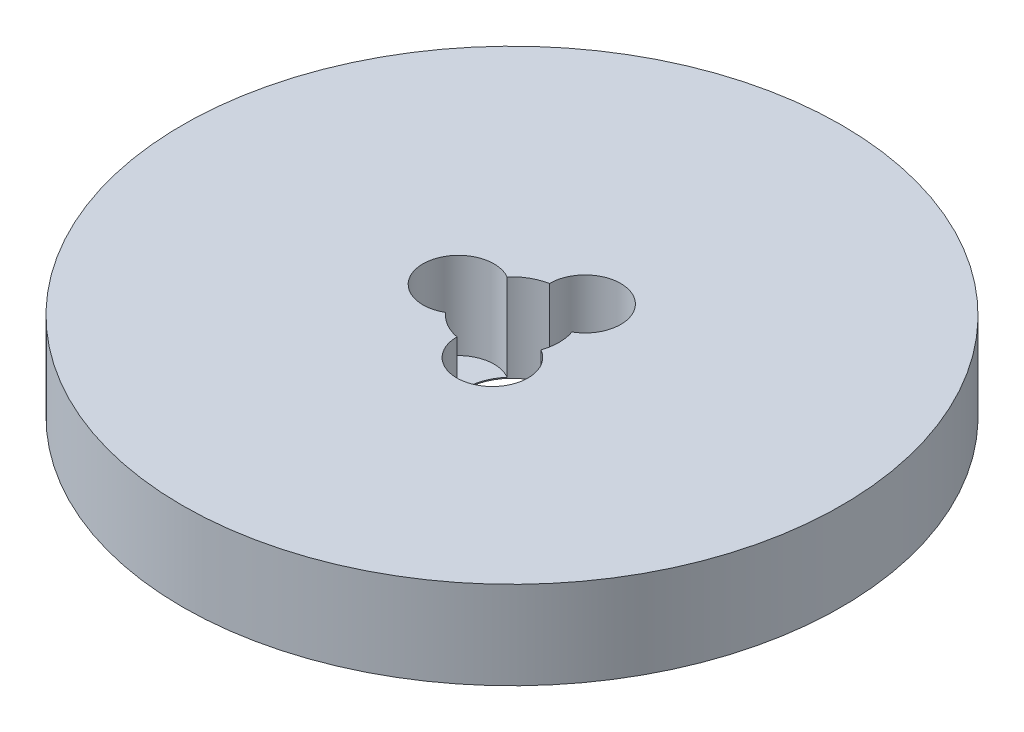
ISO-10303-21;
HEADER;
FILE_DESCRIPTION(('STEP AP214'),'2;1');
FILE_NAME('part.step','',(''),(''),'','','');
FILE_SCHEMA(('AUTOMOTIVE_DESIGN { 1 0 10303 214 1 1 1 1 }'));
ENDSEC;
DATA;
#1=APPLICATION_CONTEXT('core data for automotive mechanical design processes');
#2=APPLICATION_PROTOCOL_DEFINITION('international standard','automotive_design',2000,#1);
#3=PRODUCT_CONTEXT('',#1,'mechanical');
#4=PRODUCT('Part','Part','',(#3));
#5=PRODUCT_RELATED_PRODUCT_CATEGORY('part','',(#4));
#6=PRODUCT_DEFINITION_FORMATION('','',#4);
#7=PRODUCT_DEFINITION_CONTEXT('part definition',#1,'design');
#8=PRODUCT_DEFINITION('design','',#6,#7);
#9=PRODUCT_DEFINITION_SHAPE('','',#8);
#10=(LENGTH_UNIT() NAMED_UNIT(*) SI_UNIT(.MILLI.,.METRE.));
#11=(NAMED_UNIT(*) PLANE_ANGLE_UNIT() SI_UNIT($,.RADIAN.));
#12=(NAMED_UNIT(*) SI_UNIT($,.STERADIAN.) SOLID_ANGLE_UNIT());
#13=UNCERTAINTY_MEASURE_WITH_UNIT(LENGTH_MEASURE(1.E-05),#10,'distance_accuracy_value','');
#14=(GEOMETRIC_REPRESENTATION_CONTEXT(3) GLOBAL_UNCERTAINTY_ASSIGNED_CONTEXT((#13)) GLOBAL_UNIT_ASSIGNED_CONTEXT((#10,
#11,#12)) REPRESENTATION_CONTEXT('',''));
#15=CARTESIAN_POINT('',(0.,0.,0.));
#16=DIRECTION('',(0.,0.,1.));
#17=DIRECTION('',(1.,0.,0.));
#18=AXIS2_PLACEMENT_3D('',#15,#16,#17);
#19=CARTESIAN_POINT('',(0.,14.,0.));
#20=DIRECTION('',(0.,-1.,0.));
#21=DIRECTION('',(0.,0.,-1.));
#22=AXIS2_PLACEMENT_3D('',#19,#20,#21);
#23=CYLINDRICAL_SURFACE('',#22,52.5);
#24=CARTESIAN_POINT('',(0.,14.,0.));
#25=DIRECTION('',(0.,1.,0.));
#26=DIRECTION('',(0.,0.,1.));
#27=AXIS2_PLACEMENT_3D('',#24,#25,#26);
#28=CIRCLE('',#27,52.5);
#29=CARTESIAN_POINT('',(0.,14.,52.5));
#30=VERTEX_POINT('',#29);
#31=EDGE_CURVE('E126',#30,#30,#28,.T.);
#32=ORIENTED_EDGE('',*,*,#31,.F.);
#33=EDGE_LOOP('',(#32));
#34=FACE_BOUND('',#33,.T.);
#35=CARTESIAN_POINT('',(0.,0.,0.));
#36=DIRECTION('',(0.,1.,0.));
#37=DIRECTION('',(0.,0.,1.));
#38=AXIS2_PLACEMENT_3D('',#35,#36,#37);
#39=CIRCLE('',#38,52.5);
#40=CARTESIAN_POINT('',(0.,0.,52.5));
#41=VERTEX_POINT('',#40);
#42=EDGE_CURVE('E124',#41,#41,#39,.T.);
#43=ORIENTED_EDGE('',*,*,#42,.T.);
#44=EDGE_LOOP('',(#43));
#45=FACE_BOUND('',#44,.T.);
#46=ADVANCED_FACE('F39',(#34,#45),#23,.T.);
#47=CARTESIAN_POINT('',(0.,14.,0.));
#48=DIRECTION('',(0.,1.,0.));
#49=DIRECTION('',(0.,0.,1.));
#50=AXIS2_PLACEMENT_3D('',#47,#48,#49);
#51=PLANE('',#50);
#52=CARTESIAN_POINT('',(4.26421099276062,14.,7.38583009365503));
#53=DIRECTION('',(0.,1.,0.));
#54=DIRECTION('',(0.866025403784436,0.,-0.500000000000004));
#55=AXIS2_PLACEMENT_3D('',#52,#53,#54);
#56=CIRCLE('',#55,5.66837636374903);
#57=CARTESIAN_POINT('',(-1.40413536972342,14.,7.36738785890167));
#58=VERTEX_POINT('',#57);
#59=CARTESIAN_POINT('',(7.08241273020362,14.,2.46767702891803));
#60=VERTEX_POINT('',#59);
#61=EDGE_CURVE('E147',#58,#60,#56,.T.);
#62=ORIENTED_EDGE('',*,*,#61,.F.);
#63=CARTESIAN_POINT('',(0.,14.,0.));
#64=DIRECTION('',(0.,1.,0.));
#65=DIRECTION('',(0.,0.,1.));
#66=AXIS2_PLACEMENT_3D('',#63,#64,#65);
#67=CIRCLE('',#66,7.5);
#68=CARTESIAN_POINT('',(-5.67827736048015,14.,4.8997108299836));
#69=VERTEX_POINT('',#68);
#70=EDGE_CURVE('E118',#69,#58,#67,.T.);
#71=ORIENTED_EDGE('',*,*,#70,.F.);
#72=CARTESIAN_POINT('',(-8.52842198552116,14.,0.));
#73=DIRECTION('',(0.,1.,0.));
#74=DIRECTION('',(0.,0.,1.));
#75=AXIS2_PLACEMENT_3D('',#72,#73,#74);
#76=CIRCLE('',#75,5.66837636374903);
#77=CARTESIAN_POINT('',(-5.67827736048015,14.,-4.8997108299836));
#78=VERTEX_POINT('',#77);
#79=EDGE_CURVE('E113',#78,#69,#76,.T.);
#80=ORIENTED_EDGE('',*,*,#79,.F.);
#81=CARTESIAN_POINT('',(-1.40413536972352,14.,-7.36738785890165));
#82=VERTEX_POINT('',#81);
#83=EDGE_CURVE('E106',#82,#78,#67,.T.);
#84=ORIENTED_EDGE('',*,*,#83,.F.);
#85=CARTESIAN_POINT('',(4.26421099276051,14.,-7.38583009365509));
#86=DIRECTION('',(0.,1.,0.));
#87=DIRECTION('',(-0.866025403784443,0.,-0.499999999999992));
#88=AXIS2_PLACEMENT_3D('',#85,#86,#87);
#89=CIRCLE('',#88,5.66837636374903);
#90=CARTESIAN_POINT('',(7.08241273020358,14.,-2.46767702891813));
#91=VERTEX_POINT('',#90);
#92=EDGE_CURVE('E90',#91,#82,#89,.T.);
#93=ORIENTED_EDGE('',*,*,#92,.F.);
#94=EDGE_CURVE('E116',#60,#91,#67,.T.);
#95=ORIENTED_EDGE('',*,*,#94,.F.);
#96=EDGE_LOOP('',(#62,#71,#80,#84,#93,#95));
#97=FACE_BOUND('',#96,.T.);
#98=ORIENTED_EDGE('',*,*,#31,.T.);
#99=EDGE_LOOP('',(#98));
#100=FACE_BOUND('',#99,.T.);
#101=ADVANCED_FACE('F115',(#97,#100),#51,.T.);
#102=CARTESIAN_POINT('',(0.,0.,0.));
#103=DIRECTION('',(0.,1.,0.));
#104=DIRECTION('',(0.,0.,1.));
#105=AXIS2_PLACEMENT_3D('',#102,#103,#104);
#106=PLANE('',#105);
#107=CARTESIAN_POINT('',(0.,0.,0.));
#108=DIRECTION('',(0.,1.,0.));
#109=DIRECTION('',(0.,0.,1.));
#110=AXIS2_PLACEMENT_3D('',#107,#108,#109);
#111=CIRCLE('',#110,7.5);
#112=CARTESIAN_POINT('',(0.,0.,7.5));
#113=VERTEX_POINT('',#112);
#114=EDGE_CURVE('E120',#113,#113,#111,.T.);
#115=ORIENTED_EDGE('',*,*,#114,.T.);
#116=EDGE_LOOP('',(#115));
#117=FACE_BOUND('',#116,.T.);
#118=ORIENTED_EDGE('',*,*,#42,.F.);
#119=EDGE_LOOP('',(#118));
#120=FACE_BOUND('',#119,.T.);
#121=ADVANCED_FACE('F164',(#117,#120),#106,.F.);
#122=CARTESIAN_POINT('',(0.,14.,0.));
#123=DIRECTION('',(0.,-1.,0.));
#124=DIRECTION('',(0.,0.,-1.));
#125=AXIS2_PLACEMENT_3D('',#122,#123,#124);
#126=CYLINDRICAL_SURFACE('',#125,7.5);
#127=DIRECTION('',(0.,1.,0.));
#128=VECTOR('',#127,1.);
#129=CARTESIAN_POINT('',(-1.40413536972342,7.08116823526094,7.36738785890167));
#130=LINE('',#129,#128);
#131=CARTESIAN_POINT('',(-1.40413536972342,0.162336470521872,7.36738785890167));
#132=VERTEX_POINT('',#131);
#133=EDGE_CURVE('E11',#132,#58,#130,.T.);
#134=ORIENTED_EDGE('',*,*,#133,.F.);
#135=CARTESIAN_POINT('',(0.,0.162336470521872,0.));
#136=DIRECTION('',(0.,1.,0.));
#137=DIRECTION('',(0.,0.,1.));
#138=AXIS2_PLACEMENT_3D('',#135,#136,#137);
#139=CIRCLE('',#138,7.5);
#140=CARTESIAN_POINT('',(7.08241273020362,0.162336470521872,2.46767702891803));
#141=VERTEX_POINT('',#140);
#142=EDGE_CURVE('E144',#132,#141,#139,.T.);
#143=ORIENTED_EDGE('',*,*,#142,.T.);
#144=DIRECTION('',(0.,1.,0.));
#145=VECTOR('',#144,1.);
#146=CARTESIAN_POINT('',(7.08241273020362,7.08116823526094,2.46767702891803));
#147=LINE('',#146,#145);
#148=EDGE_CURVE('E46',#60,#141,#147,.F.);
#149=ORIENTED_EDGE('',*,*,#148,.F.);
#150=ORIENTED_EDGE('',*,*,#94,.T.);
#151=DIRECTION('',(0.,1.,0.));
#152=VECTOR('',#151,1.);
#153=CARTESIAN_POINT('',(7.08241273020358,7.08116823526094,-2.46767702891813));
#154=LINE('',#153,#152);
#155=CARTESIAN_POINT('',(7.08241273020358,0.162336470521872,-2.46767702891813));
#156=VERTEX_POINT('',#155);
#157=EDGE_CURVE('E92',#156,#91,#154,.T.);
#158=ORIENTED_EDGE('',*,*,#157,.F.);
#159=CARTESIAN_POINT('',(0.,0.162336470521872,0.));
#160=DIRECTION('',(0.,1.,0.));
#161=DIRECTION('',(0.,0.,1.));
#162=AXIS2_PLACEMENT_3D('',#159,#160,#161);
#163=CIRCLE('',#162,7.5);
#164=CARTESIAN_POINT('',(-1.40413536972352,0.162336470521872,-7.36738785890165));
#165=VERTEX_POINT('',#164);
#166=EDGE_CURVE('E107',#156,#165,#163,.T.);
#167=ORIENTED_EDGE('',*,*,#166,.T.);
#168=DIRECTION('',(0.,1.,0.));
#169=VECTOR('',#168,1.);
#170=CARTESIAN_POINT('',(-1.40413536972352,7.08116823526094,-7.36738785890165));
#171=LINE('',#170,#169);
#172=EDGE_CURVE('E95',#82,#165,#171,.F.);
#173=ORIENTED_EDGE('',*,*,#172,.F.);
#174=ORIENTED_EDGE('',*,*,#83,.T.);
#175=DIRECTION('',(0.,1.,0.));
#176=VECTOR('',#175,1.);
#177=CARTESIAN_POINT('',(-5.67827736048015,7.08116823526094,-4.8997108299836));
#178=LINE('',#177,#176);
#179=CARTESIAN_POINT('',(-5.67827736048015,0.162336470521872,-4.8997108299836));
#180=VERTEX_POINT('',#179);
#181=EDGE_CURVE('E143',#180,#78,#178,.T.);
#182=ORIENTED_EDGE('',*,*,#181,.F.);
#183=CARTESIAN_POINT('',(0.,0.162336470521872,0.));
#184=DIRECTION('',(0.,1.,0.));
#185=DIRECTION('',(0.,0.,1.));
#186=AXIS2_PLACEMENT_3D('',#183,#184,#185);
#187=CIRCLE('',#186,7.5);
#188=CARTESIAN_POINT('',(-5.67827736048015,0.162336470521872,4.8997108299836));
#189=VERTEX_POINT('',#188);
#190=EDGE_CURVE('E132',#180,#189,#187,.T.);
#191=ORIENTED_EDGE('',*,*,#190,.T.);
#192=DIRECTION('',(0.,1.,0.));
#193=VECTOR('',#192,1.);
#194=CARTESIAN_POINT('',(-5.67827736048015,7.08116823526094,4.8997108299836));
#195=LINE('',#194,#193);
#196=EDGE_CURVE('E137',#69,#189,#195,.F.);
#197=ORIENTED_EDGE('',*,*,#196,.F.);
#198=ORIENTED_EDGE('',*,*,#70,.T.);
#199=EDGE_LOOP('',(#134,#143,#149,#150,#158,#167,#173,#174,#182,#191,#197,#198));
#200=FACE_BOUND('',#199,.T.);
#201=ORIENTED_EDGE('',*,*,#114,.F.);
#202=EDGE_LOOP('',(#201));
#203=FACE_BOUND('',#202,.T.);
#204=ADVANCED_FACE('F103',(#200,#203),#126,.F.);
#205=CARTESIAN_POINT('',(-8.52842198552116,0.162336470521872,0.));
#206=DIRECTION('',(0.,1.,0.));
#207=DIRECTION('',(0.,0.,1.));
#208=AXIS2_PLACEMENT_3D('',#205,#206,#207);
#209=CYLINDRICAL_SURFACE('',#208,5.66837636374903);
#210=ORIENTED_EDGE('',*,*,#181,.T.);
#211=ORIENTED_EDGE('',*,*,#79,.T.);
#212=ORIENTED_EDGE('',*,*,#196,.T.);
#213=CARTESIAN_POINT('',(-8.52842198552116,0.162336470521872,0.));
#214=DIRECTION('',(0.,1.,0.));
#215=DIRECTION('',(0.,0.,1.));
#216=AXIS2_PLACEMENT_3D('',#213,#214,#215);
#217=CIRCLE('',#216,5.66837636374903);
#218=EDGE_CURVE('E121',#180,#189,#217,.T.);
#219=ORIENTED_EDGE('',*,*,#218,.F.);
#220=EDGE_LOOP('',(#210,#211,#212,#219));
#221=FACE_BOUND('',#220,.T.);
#222=ADVANCED_FACE('F174',(#221),#209,.F.);
#223=CARTESIAN_POINT('',(-8.52842198552116,0.162336470521872,0.));
#224=DIRECTION('',(0.,1.,0.));
#225=DIRECTION('',(0.,0.,1.));
#226=AXIS2_PLACEMENT_3D('',#223,#224,#225);
#227=PLANE('',#226);
#228=ORIENTED_EDGE('',*,*,#218,.T.);
#229=ORIENTED_EDGE('',*,*,#190,.F.);
#230=EDGE_LOOP('',(#228,#229));
#231=FACE_BOUND('',#230,.T.);
#232=ADVANCED_FACE('F177',(#231),#227,.T.);
#233=CARTESIAN_POINT('',(4.26421099276051,0.162336470521872,-7.38583009365509));
#234=DIRECTION('',(0.,1.,0.));
#235=DIRECTION('',(0.,0.,1.));
#236=AXIS2_PLACEMENT_3D('',#233,#234,#235);
#237=CYLINDRICAL_SURFACE('',#236,5.66837636374903);
#238=ORIENTED_EDGE('',*,*,#157,.T.);
#239=ORIENTED_EDGE('',*,*,#92,.T.);
#240=ORIENTED_EDGE('',*,*,#172,.T.);
#241=CARTESIAN_POINT('',(4.26421099276051,0.162336470521872,-7.38583009365509));
#242=DIRECTION('',(0.,1.,0.));
#243=DIRECTION('',(-0.866025403784443,0.,-0.499999999999992));
#244=AXIS2_PLACEMENT_3D('',#241,#242,#243);
#245=CIRCLE('',#244,5.66837636374903);
#246=EDGE_CURVE('E56',#156,#165,#245,.T.);
#247=ORIENTED_EDGE('',*,*,#246,.F.);
#248=EDGE_LOOP('',(#238,#239,#240,#247));
#249=FACE_BOUND('',#248,.T.);
#250=ADVANCED_FACE('F93',(#249),#237,.F.);
#251=CARTESIAN_POINT('',(4.26421099276051,0.162336470521872,-7.38583009365509));
#252=DIRECTION('',(0.,1.,0.));
#253=DIRECTION('',(-0.866025403784443,0.,-0.499999999999992));
#254=AXIS2_PLACEMENT_3D('',#251,#252,#253);
#255=PLANE('',#254);
#256=ORIENTED_EDGE('',*,*,#246,.T.);
#257=ORIENTED_EDGE('',*,*,#166,.F.);
#258=EDGE_LOOP('',(#256,#257));
#259=FACE_BOUND('',#258,.T.);
#260=ADVANCED_FACE('F160',(#259),#255,.T.);
#261=CARTESIAN_POINT('',(4.26421099276062,0.162336470521872,7.38583009365503));
#262=DIRECTION('',(0.,1.,0.));
#263=DIRECTION('',(0.,0.,1.));
#264=AXIS2_PLACEMENT_3D('',#261,#262,#263);
#265=CYLINDRICAL_SURFACE('',#264,5.66837636374903);
#266=ORIENTED_EDGE('',*,*,#133,.T.);
#267=ORIENTED_EDGE('',*,*,#61,.T.);
#268=ORIENTED_EDGE('',*,*,#148,.T.);
#269=CARTESIAN_POINT('',(4.26421099276062,0.162336470521872,7.38583009365503));
#270=DIRECTION('',(0.,1.,0.));
#271=DIRECTION('',(0.866025403784436,0.,-0.500000000000004));
#272=AXIS2_PLACEMENT_3D('',#269,#270,#271);
#273=CIRCLE('',#272,5.66837636374903);
#274=EDGE_CURVE('E55',#132,#141,#273,.T.);
#275=ORIENTED_EDGE('',*,*,#274,.F.);
#276=EDGE_LOOP('',(#266,#267,#268,#275));
#277=FACE_BOUND('',#276,.T.);
#278=ADVANCED_FACE('F149',(#277),#265,.F.);
#279=CARTESIAN_POINT('',(4.26421099276062,0.162336470521872,7.38583009365503));
#280=DIRECTION('',(0.,1.,0.));
#281=DIRECTION('',(0.866025403784436,0.,-0.500000000000004));
#282=AXIS2_PLACEMENT_3D('',#279,#280,#281);
#283=PLANE('',#282);
#284=ORIENTED_EDGE('',*,*,#274,.T.);
#285=ORIENTED_EDGE('',*,*,#142,.F.);
#286=EDGE_LOOP('',(#284,#285));
#287=FACE_BOUND('',#286,.T.);
#288=ADVANCED_FACE('F151',(#287),#283,.T.);
#289=CLOSED_SHELL('',(#46,#101,#121,#204,#222,#232,#250,#260,#278,#288));
#290=MANIFOLD_SOLID_BREP('B2',#289);
#291=ADVANCED_BREP_SHAPE_REPRESENTATION('',(#18,#290),#14);
#292=SHAPE_DEFINITION_REPRESENTATION(#9,#291);
ENDSEC;
END-ISO-10303-21;
